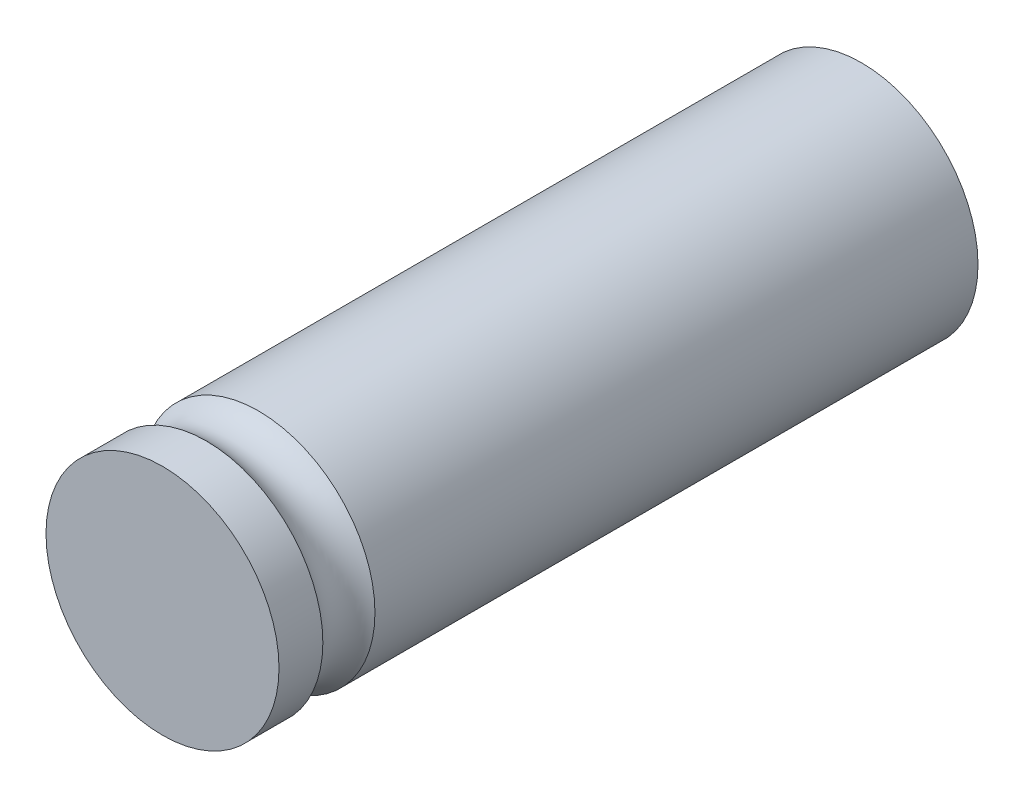
ISO-10303-21;
HEADER;
FILE_DESCRIPTION(('STEP AP214'),'2;1');
FILE_NAME('part.step','',(''),(''),'','','');
FILE_SCHEMA(('AUTOMOTIVE_DESIGN { 1 0 10303 214 1 1 1 1 }'));
ENDSEC;
DATA;
#1=APPLICATION_CONTEXT('core data for automotive mechanical design processes');
#2=APPLICATION_PROTOCOL_DEFINITION('international standard','automotive_design',2000,#1);
#3=PRODUCT_CONTEXT('',#1,'mechanical');
#4=PRODUCT('Part','Part','',(#3));
#5=PRODUCT_RELATED_PRODUCT_CATEGORY('part','',(#4));
#6=PRODUCT_DEFINITION_FORMATION('','',#4);
#7=PRODUCT_DEFINITION_CONTEXT('part definition',#1,'design');
#8=PRODUCT_DEFINITION('design','',#6,#7);
#9=PRODUCT_DEFINITION_SHAPE('','',#8);
#10=(LENGTH_UNIT() NAMED_UNIT(*) SI_UNIT(.MILLI.,.METRE.));
#11=(NAMED_UNIT(*) PLANE_ANGLE_UNIT() SI_UNIT($,.RADIAN.));
#12=(NAMED_UNIT(*) SI_UNIT($,.STERADIAN.) SOLID_ANGLE_UNIT());
#13=UNCERTAINTY_MEASURE_WITH_UNIT(LENGTH_MEASURE(1.E-05),#10,'distance_accuracy_value','');
#14=(GEOMETRIC_REPRESENTATION_CONTEXT(3) GLOBAL_UNCERTAINTY_ASSIGNED_CONTEXT((#13)) GLOBAL_UNIT_ASSIGNED_CONTEXT((#10,
#11,#12)) REPRESENTATION_CONTEXT('',''));
#15=CARTESIAN_POINT('',(0.,0.,0.));
#16=DIRECTION('',(0.,0.,1.));
#17=DIRECTION('',(1.,0.,0.));
#18=AXIS2_PLACEMENT_3D('',#15,#16,#17);
#19=CARTESIAN_POINT('',(0.,0.,30.));
#20=DIRECTION('',(0.,0.,-1.));
#21=DIRECTION('',(-1.,0.,0.));
#22=AXIS2_PLACEMENT_3D('',#19,#20,#21);
#23=CYLINDRICAL_SURFACE('',#22,5.);
#24=CARTESIAN_POINT('',(0.,0.,25.8819660112501));
#25=DIRECTION('',(0.,0.,1.));
#26=DIRECTION('',(1.,0.,0.));
#27=AXIS2_PLACEMENT_3D('',#24,#25,#26);
#28=CIRCLE('',#27,5.);
#29=CARTESIAN_POINT('',(5.,0.,25.8819660112501));
#30=VERTEX_POINT('',#29);
#31=EDGE_CURVE('E36',#30,#30,#28,.F.);
#32=ORIENTED_EDGE('',*,*,#31,.T.);
#33=EDGE_LOOP('',(#32));
#34=FACE_BOUND('',#33,.T.);
#35=CARTESIAN_POINT('',(0.,0.,0.));
#36=DIRECTION('',(0.,0.,1.));
#37=DIRECTION('',(1.,0.,0.));
#38=AXIS2_PLACEMENT_3D('',#35,#36,#37);
#39=CIRCLE('',#38,5.);
#40=CARTESIAN_POINT('',(5.,0.,0.));
#41=VERTEX_POINT('',#40);
#42=EDGE_CURVE('E40',#41,#41,#39,.T.);
#43=ORIENTED_EDGE('',*,*,#42,.T.);
#44=EDGE_LOOP('',(#43));
#45=FACE_BOUND('',#44,.T.);
#46=ADVANCED_FACE('F32',(#34,#45),#23,.T.);
#47=CARTESIAN_POINT('',(0.,0.,0.));
#48=DIRECTION('',(0.,0.,1.));
#49=DIRECTION('',(1.,0.,0.));
#50=AXIS2_PLACEMENT_3D('',#47,#48,#49);
#51=PLANE('',#50);
#52=ORIENTED_EDGE('',*,*,#42,.F.);
#53=EDGE_LOOP('',(#52));
#54=FACE_BOUND('',#53,.T.);
#55=ADVANCED_FACE('F58',(#54),#51,.F.);
#56=CARTESIAN_POINT('',(0.,0.,27.));
#57=DIRECTION('',(0.,0.,-1.));
#58=DIRECTION('',(-1.,0.,0.));
#59=AXIS2_PLACEMENT_3D('',#56,#57,#58);
#60=TOROIDAL_SURFACE('',#59,6.,1.5);
#61=CARTESIAN_POINT('',(0.,0.,28.1180339887499));
#62=DIRECTION('',(0.,0.,-1.));
#63=DIRECTION('',(-1.,0.,0.));
#64=AXIS2_PLACEMENT_3D('',#61,#62,#63);
#65=CIRCLE('',#64,5.);
#66=CARTESIAN_POINT('',(-5.,0.,28.1180339887499));
#67=VERTEX_POINT('',#66);
#68=EDGE_CURVE('E46',#67,#67,#65,.F.);
#69=ORIENTED_EDGE('',*,*,#68,.F.);
#70=EDGE_LOOP('',(#69));
#71=FACE_BOUND('',#70,.T.);
#72=ORIENTED_EDGE('',*,*,#31,.F.);
#73=EDGE_LOOP('',(#72));
#74=FACE_BOUND('',#73,.T.);
#75=ADVANCED_FACE('F55',(#71,#74),#60,.F.);
#76=CARTESIAN_POINT('',(0.,0.,30.));
#77=DIRECTION('',(0.,0.,1.));
#78=DIRECTION('',(1.,0.,0.));
#79=AXIS2_PLACEMENT_3D('',#76,#77,#78);
#80=PLANE('',#79);
#81=CARTESIAN_POINT('',(0.,0.,30.));
#82=DIRECTION('',(0.,0.,1.));
#83=DIRECTION('',(1.,0.,0.));
#84=AXIS2_PLACEMENT_3D('',#81,#82,#83);
#85=CIRCLE('',#84,5.);
#86=CARTESIAN_POINT('',(5.,0.,30.));
#87=VERTEX_POINT('',#86);
#88=EDGE_CURVE('E10',#87,#87,#85,.T.);
#89=ORIENTED_EDGE('',*,*,#88,.T.);
#90=EDGE_LOOP('',(#89));
#91=FACE_BOUND('',#90,.T.);
#92=ADVANCED_FACE('F57',(#91),#80,.T.);
#93=ORIENTED_EDGE('',*,*,#68,.T.);
#94=EDGE_LOOP('',(#93));
#95=FACE_BOUND('',#94,.T.);
#96=ORIENTED_EDGE('',*,*,#88,.F.);
#97=EDGE_LOOP('',(#96));
#98=FACE_BOUND('',#97,.T.);
#99=ADVANCED_FACE('F34',(#95,#98),#23,.T.);
#100=CLOSED_SHELL('',(#46,#55,#75,#92,#99));
#101=MANIFOLD_SOLID_BREP('B2',#100);
#102=ADVANCED_BREP_SHAPE_REPRESENTATION('',(#18,#101),#14);
#103=SHAPE_DEFINITION_REPRESENTATION(#9,#102);
ENDSEC;
END-ISO-10303-21;
